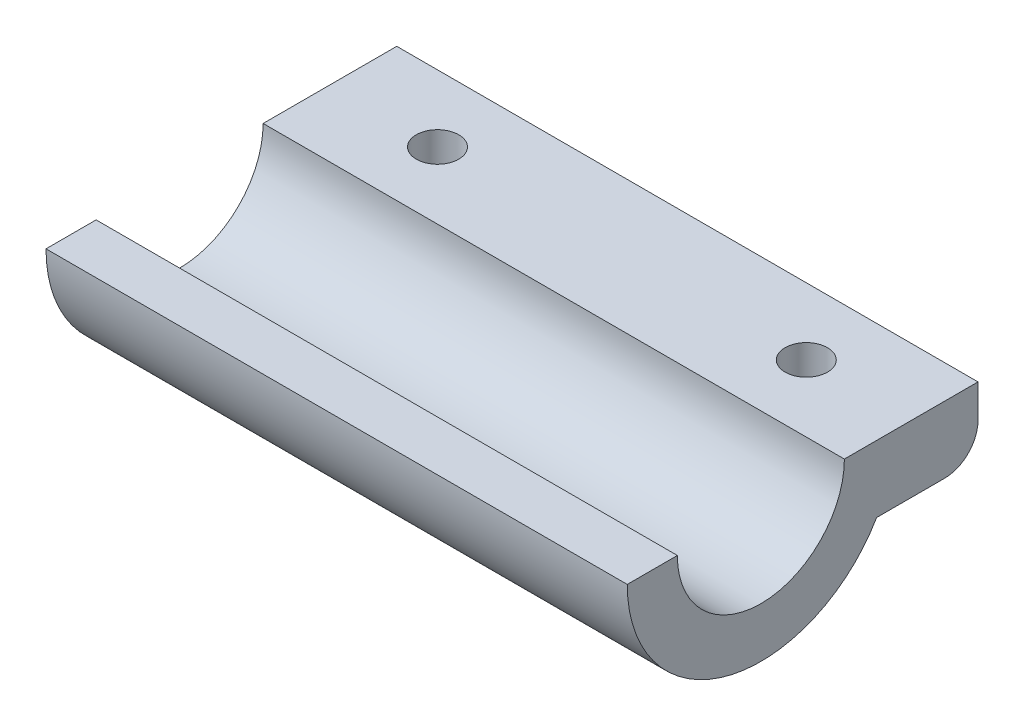
ISO-10303-21;
HEADER;
FILE_DESCRIPTION(('STEP AP214'),'2;1');
FILE_NAME('part.step','',(''),(''),'','','');
FILE_SCHEMA(('AUTOMOTIVE_DESIGN { 1 0 10303 214 1 1 1 1 }'));
ENDSEC;
DATA;
#1=APPLICATION_CONTEXT('core data for automotive mechanical design processes');
#2=APPLICATION_PROTOCOL_DEFINITION('international standard','automotive_design',2000,#1);
#3=PRODUCT_CONTEXT('',#1,'mechanical');
#4=PRODUCT('Part','Part','',(#3));
#5=PRODUCT_RELATED_PRODUCT_CATEGORY('part','',(#4));
#6=PRODUCT_DEFINITION_FORMATION('','',#4);
#7=PRODUCT_DEFINITION_CONTEXT('part definition',#1,'design');
#8=PRODUCT_DEFINITION('design','',#6,#7);
#9=PRODUCT_DEFINITION_SHAPE('','',#8);
#10=(LENGTH_UNIT() NAMED_UNIT(*) SI_UNIT(.MILLI.,.METRE.));
#11=(NAMED_UNIT(*) PLANE_ANGLE_UNIT() SI_UNIT($,.RADIAN.));
#12=(NAMED_UNIT(*) SI_UNIT($,.STERADIAN.) SOLID_ANGLE_UNIT());
#13=UNCERTAINTY_MEASURE_WITH_UNIT(LENGTH_MEASURE(1.E-05),#10,'distance_accuracy_value','');
#14=(GEOMETRIC_REPRESENTATION_CONTEXT(3) GLOBAL_UNCERTAINTY_ASSIGNED_CONTEXT((#13)) GLOBAL_UNIT_ASSIGNED_CONTEXT((#10,
#11,#12)) REPRESENTATION_CONTEXT('',''));
#15=CARTESIAN_POINT('',(0.,0.,0.));
#16=DIRECTION('',(0.,0.,1.));
#17=DIRECTION('',(1.,0.,0.));
#18=AXIS2_PLACEMENT_3D('',#15,#16,#17);
#19=CARTESIAN_POINT('',(87.,0.,12.5));
#20=DIRECTION('',(-1.,0.,0.));
#21=DIRECTION('',(0.,0.,1.));
#22=AXIS2_PLACEMENT_3D('',#19,#20,#21);
#23=CYLINDRICAL_SURFACE('',#22,12.5);
#24=CARTESIAN_POINT('',(0.,0.,12.5));
#25=DIRECTION('',(1.,0.,0.));
#26=DIRECTION('',(0.,0.,-1.));
#27=AXIS2_PLACEMENT_3D('',#24,#25,#26);
#28=CIRCLE('',#27,12.5);
#29=CARTESIAN_POINT('',(0.,0.,25.));
#30=VERTEX_POINT('',#29);
#31=CARTESIAN_POINT('',(0.,0.,0.));
#32=VERTEX_POINT('',#31);
#33=EDGE_CURVE('E131',#30,#32,#28,.T.);
#34=ORIENTED_EDGE('',*,*,#33,.F.);
#35=DIRECTION('',(-1.,0.,0.));
#36=VECTOR('',#35,1.);
#37=CARTESIAN_POINT('',(87.,0.,25.));
#38=LINE('',#37,#36);
#39=CARTESIAN_POINT('',(87.,0.,25.));
#40=VERTEX_POINT('',#39);
#41=EDGE_CURVE('E115',#40,#30,#38,.T.);
#42=ORIENTED_EDGE('',*,*,#41,.F.);
#43=CARTESIAN_POINT('',(87.,0.,12.5));
#44=DIRECTION('',(1.,0.,0.));
#45=DIRECTION('',(0.,0.,-1.));
#46=AXIS2_PLACEMENT_3D('',#43,#44,#45);
#47=CIRCLE('',#46,12.5);
#48=CARTESIAN_POINT('',(87.,0.,0.));
#49=VERTEX_POINT('',#48);
#50=EDGE_CURVE('E110',#40,#49,#47,.T.);
#51=ORIENTED_EDGE('',*,*,#50,.T.);
#52=DIRECTION('',(-1.,0.,0.));
#53=VECTOR('',#52,1.);
#54=CARTESIAN_POINT('',(87.,0.,0.));
#55=LINE('',#54,#53);
#56=EDGE_CURVE('E92',#49,#32,#55,.T.);
#57=ORIENTED_EDGE('',*,*,#56,.T.);
#58=EDGE_LOOP('',(#34,#42,#51,#57));
#59=FACE_BOUND('',#58,.T.);
#60=ADVANCED_FACE('F33',(#59),#23,.F.);
#61=CARTESIAN_POINT('',(87.,0.,32.5));
#62=DIRECTION('',(0.,1.,0.));
#63=DIRECTION('',(0.,0.,1.));
#64=AXIS2_PLACEMENT_3D('',#61,#62,#63);
#65=PLANE('',#64);
#66=DIRECTION('',(0.,0.,-1.));
#67=VECTOR('',#66,1.);
#68=CARTESIAN_POINT('',(0.,0.,32.5));
#69=LINE('',#68,#67);
#70=CARTESIAN_POINT('',(0.,0.,32.5));
#71=VERTEX_POINT('',#70);
#72=EDGE_CURVE('E116',#71,#30,#69,.T.);
#73=ORIENTED_EDGE('',*,*,#72,.F.);
#74=DIRECTION('',(-1.,0.,0.));
#75=VECTOR('',#74,1.);
#76=CARTESIAN_POINT('',(87.,0.,32.5));
#77=LINE('',#76,#75);
#78=CARTESIAN_POINT('',(87.,0.,32.5));
#79=VERTEX_POINT('',#78);
#80=EDGE_CURVE('E141',#79,#71,#77,.T.);
#81=ORIENTED_EDGE('',*,*,#80,.F.);
#82=DIRECTION('',(0.,0.,-1.));
#83=VECTOR('',#82,1.);
#84=CARTESIAN_POINT('',(87.,0.,32.5));
#85=LINE('',#84,#83);
#86=EDGE_CURVE('E103',#79,#40,#85,.T.);
#87=ORIENTED_EDGE('',*,*,#86,.T.);
#88=ORIENTED_EDGE('',*,*,#41,.T.);
#89=EDGE_LOOP('',(#73,#81,#87,#88));
#90=FACE_BOUND('',#89,.T.);
#91=ADVANCED_FACE('F159',(#90),#65,.T.);
#92=CARTESIAN_POINT('',(87.,0.,12.5));
#93=DIRECTION('',(-1.,0.,0.));
#94=DIRECTION('',(0.,0.,1.));
#95=AXIS2_PLACEMENT_3D('',#92,#93,#94);
#96=CYLINDRICAL_SURFACE('',#95,20.);
#97=CARTESIAN_POINT('',(0.,0.,12.5));
#98=DIRECTION('',(1.,0.,0.));
#99=DIRECTION('',(0.,0.,-1.));
#100=AXIS2_PLACEMENT_3D('',#97,#98,#99);
#101=CIRCLE('',#100,20.);
#102=CARTESIAN_POINT('',(0.,-10.,-4.82050807568878));
#103=VERTEX_POINT('',#102);
#104=EDGE_CURVE('E119',#71,#103,#101,.T.);
#105=ORIENTED_EDGE('',*,*,#104,.T.);
#106=DIRECTION('',(-1.,0.,0.));
#107=VECTOR('',#106,1.);
#108=CARTESIAN_POINT('',(87.,-10.,-4.82050807568878));
#109=LINE('',#108,#107);
#110=CARTESIAN_POINT('',(87.,-10.,-4.82050807568878));
#111=VERTEX_POINT('',#110);
#112=EDGE_CURVE('E143',#111,#103,#109,.T.);
#113=ORIENTED_EDGE('',*,*,#112,.F.);
#114=CARTESIAN_POINT('',(87.,0.,12.5));
#115=DIRECTION('',(1.,0.,0.));
#116=DIRECTION('',(0.,0.,-1.));
#117=AXIS2_PLACEMENT_3D('',#114,#115,#116);
#118=CIRCLE('',#117,20.);
#119=EDGE_CURVE('E128',#79,#111,#118,.T.);
#120=ORIENTED_EDGE('',*,*,#119,.F.);
#121=ORIENTED_EDGE('',*,*,#80,.T.);
#122=EDGE_LOOP('',(#105,#113,#120,#121));
#123=FACE_BOUND('',#122,.T.);
#124=ADVANCED_FACE('F163',(#123),#96,.T.);
#125=CARTESIAN_POINT('',(87.,-10.,-4.82050807568878));
#126=DIRECTION('',(0.,1.,0.));
#127=DIRECTION('',(0.,0.,1.));
#128=AXIS2_PLACEMENT_3D('',#125,#126,#127);
#129=PLANE('',#128);
#130=CARTESIAN_POINT('',(71.3,-10.,-10.));
#131=DIRECTION('',(0.,1.,0.));
#132=DIRECTION('',(0.,0.,1.));
#133=AXIS2_PLACEMENT_3D('',#130,#131,#132);
#134=CIRCLE('',#133,3.175);
#135=CARTESIAN_POINT('',(71.3,-10.,-6.82500000000001));
#136=VERTEX_POINT('',#135);
#137=EDGE_CURVE('E122',#136,#136,#134,.T.);
#138=ORIENTED_EDGE('',*,*,#137,.T.);
#139=EDGE_LOOP('',(#138));
#140=FACE_BOUND('',#139,.T.);
#141=CARTESIAN_POINT('',(16.1,-10.,-10.));
#142=DIRECTION('',(0.,1.,0.));
#143=DIRECTION('',(0.,0.,1.));
#144=AXIS2_PLACEMENT_3D('',#141,#142,#143);
#145=CIRCLE('',#144,3.175);
#146=CARTESIAN_POINT('',(16.1,-10.,-6.825));
#147=VERTEX_POINT('',#146);
#148=EDGE_CURVE('E197',#147,#147,#145,.T.);
#149=ORIENTED_EDGE('',*,*,#148,.T.);
#150=EDGE_LOOP('',(#149));
#151=FACE_BOUND('',#150,.T.);
#152=DIRECTION('',(0.,0.,-1.));
#153=VECTOR('',#152,1.);
#154=CARTESIAN_POINT('',(0.,-10.,-4.82050807568878));
#155=LINE('',#154,#153);
#156=CARTESIAN_POINT('',(0.,-10.,-15.));
#157=VERTEX_POINT('',#156);
#158=EDGE_CURVE('E136',#103,#157,#155,.T.);
#159=ORIENTED_EDGE('',*,*,#158,.T.);
#160=DIRECTION('',(-1.,0.,0.));
#161=VECTOR('',#160,1.);
#162=CARTESIAN_POINT('',(87.,-10.,-15.));
#163=LINE('',#162,#161);
#164=CARTESIAN_POINT('',(87.,-10.,-15.));
#165=VERTEX_POINT('',#164);
#166=EDGE_CURVE('E41',#157,#165,#163,.F.);
#167=ORIENTED_EDGE('',*,*,#166,.T.);
#168=DIRECTION('',(0.,0.,-1.));
#169=VECTOR('',#168,1.);
#170=CARTESIAN_POINT('',(87.,-10.,-4.82050807568878));
#171=LINE('',#170,#169);
#172=EDGE_CURVE('E126',#111,#165,#171,.T.);
#173=ORIENTED_EDGE('',*,*,#172,.F.);
#174=ORIENTED_EDGE('',*,*,#112,.T.);
#175=EDGE_LOOP('',(#159,#167,#173,#174));
#176=FACE_BOUND('',#175,.T.);
#177=ADVANCED_FACE('F164',(#140,#151,#176),#129,.F.);
#178=CARTESIAN_POINT('',(87.,0.,-20.));
#179=DIRECTION('',(0.,0.,-1.));
#180=DIRECTION('',(-1.,0.,0.));
#181=AXIS2_PLACEMENT_3D('',#178,#179,#180);
#182=PLANE('',#181);
#183=DIRECTION('',(0.,-1.,0.));
#184=VECTOR('',#183,1.);
#185=CARTESIAN_POINT('',(87.,0.,-20.));
#186=LINE('',#185,#184);
#187=CARTESIAN_POINT('',(87.,0.,-20.));
#188=VERTEX_POINT('',#187);
#189=CARTESIAN_POINT('',(87.,-5.,-20.));
#190=VERTEX_POINT('',#189);
#191=EDGE_CURVE('E113',#188,#190,#186,.T.);
#192=ORIENTED_EDGE('',*,*,#191,.T.);
#193=DIRECTION('',(-1.,0.,0.));
#194=VECTOR('',#193,1.);
#195=CARTESIAN_POINT('',(0.,-5.,-20.));
#196=LINE('',#195,#194);
#197=CARTESIAN_POINT('',(0.,-5.,-20.));
#198=VERTEX_POINT('',#197);
#199=EDGE_CURVE('E140',#190,#198,#196,.T.);
#200=ORIENTED_EDGE('',*,*,#199,.T.);
#201=DIRECTION('',(0.,-1.,0.));
#202=VECTOR('',#201,1.);
#203=CARTESIAN_POINT('',(0.,0.,-20.));
#204=LINE('',#203,#202);
#205=CARTESIAN_POINT('',(0.,0.,-20.));
#206=VERTEX_POINT('',#205);
#207=EDGE_CURVE('E134',#206,#198,#204,.T.);
#208=ORIENTED_EDGE('',*,*,#207,.F.);
#209=DIRECTION('',(-1.,0.,0.));
#210=VECTOR('',#209,1.);
#211=CARTESIAN_POINT('',(87.,0.,-20.));
#212=LINE('',#211,#210);
#213=EDGE_CURVE('E102',#188,#206,#212,.T.);
#214=ORIENTED_EDGE('',*,*,#213,.F.);
#215=EDGE_LOOP('',(#192,#200,#208,#214));
#216=FACE_BOUND('',#215,.T.);
#217=ADVANCED_FACE('F152',(#216),#182,.T.);
#218=CARTESIAN_POINT('',(87.,0.,0.));
#219=DIRECTION('',(0.,1.,0.));
#220=DIRECTION('',(0.,0.,1.));
#221=AXIS2_PLACEMENT_3D('',#218,#219,#220);
#222=PLANE('',#221);
#223=CARTESIAN_POINT('',(71.3,0.,-10.));
#224=DIRECTION('',(0.,1.,0.));
#225=DIRECTION('',(0.,0.,1.));
#226=AXIS2_PLACEMENT_3D('',#223,#224,#225);
#227=CIRCLE('',#226,3.175);
#228=CARTESIAN_POINT('',(71.3,0.,-6.82500000000001));
#229=VERTEX_POINT('',#228);
#230=EDGE_CURVE('E191',#229,#229,#227,.T.);
#231=ORIENTED_EDGE('',*,*,#230,.F.);
#232=EDGE_LOOP('',(#231));
#233=FACE_BOUND('',#232,.T.);
#234=CARTESIAN_POINT('',(16.1,0.,-10.));
#235=DIRECTION('',(0.,1.,0.));
#236=DIRECTION('',(0.,0.,1.));
#237=AXIS2_PLACEMENT_3D('',#234,#235,#236);
#238=CIRCLE('',#237,3.175);
#239=CARTESIAN_POINT('',(16.1,0.,-6.825));
#240=VERTEX_POINT('',#239);
#241=EDGE_CURVE('E194',#240,#240,#238,.T.);
#242=ORIENTED_EDGE('',*,*,#241,.F.);
#243=EDGE_LOOP('',(#242));
#244=FACE_BOUND('',#243,.T.);
#245=DIRECTION('',(0.,0.,-1.));
#246=VECTOR('',#245,1.);
#247=CARTESIAN_POINT('',(0.,0.,0.));
#248=LINE('',#247,#246);
#249=EDGE_CURVE('E97',#32,#206,#248,.T.);
#250=ORIENTED_EDGE('',*,*,#249,.F.);
#251=ORIENTED_EDGE('',*,*,#56,.F.);
#252=DIRECTION('',(0.,0.,-1.));
#253=VECTOR('',#252,1.);
#254=CARTESIAN_POINT('',(87.,0.,0.));
#255=LINE('',#254,#253);
#256=EDGE_CURVE('E95',#49,#188,#255,.T.);
#257=ORIENTED_EDGE('',*,*,#256,.T.);
#258=ORIENTED_EDGE('',*,*,#213,.T.);
#259=EDGE_LOOP('',(#250,#251,#257,#258));
#260=FACE_BOUND('',#259,.T.);
#261=ADVANCED_FACE('F94',(#233,#244,#260),#222,.T.);
#262=CARTESIAN_POINT('',(87.,0.,12.5));
#263=DIRECTION('',(1.,0.,0.));
#264=DIRECTION('',(0.,0.,-1.));
#265=AXIS2_PLACEMENT_3D('',#262,#263,#264);
#266=PLANE('',#265);
#267=ORIENTED_EDGE('',*,*,#172,.T.);
#268=CARTESIAN_POINT('',(87.,-5.,-15.));
#269=DIRECTION('',(1.,0.,0.));
#270=DIRECTION('',(0.,0.,-1.));
#271=AXIS2_PLACEMENT_3D('',#268,#269,#270);
#272=CIRCLE('',#271,5.);
#273=EDGE_CURVE('E11',#165,#190,#272,.T.);
#274=ORIENTED_EDGE('',*,*,#273,.T.);
#275=ORIENTED_EDGE('',*,*,#191,.F.);
#276=ORIENTED_EDGE('',*,*,#256,.F.);
#277=ORIENTED_EDGE('',*,*,#50,.F.);
#278=ORIENTED_EDGE('',*,*,#86,.F.);
#279=ORIENTED_EDGE('',*,*,#119,.T.);
#280=EDGE_LOOP('',(#267,#274,#275,#276,#277,#278,#279));
#281=FACE_BOUND('',#280,.T.);
#282=ADVANCED_FACE('F108',(#281),#266,.T.);
#283=CARTESIAN_POINT('',(0.,0.,12.5));
#284=DIRECTION('',(1.,0.,0.));
#285=DIRECTION('',(0.,0.,-1.));
#286=AXIS2_PLACEMENT_3D('',#283,#284,#285);
#287=PLANE('',#286);
#288=ORIENTED_EDGE('',*,*,#207,.T.);
#289=CARTESIAN_POINT('',(0.,-5.,-15.));
#290=DIRECTION('',(1.,0.,0.));
#291=DIRECTION('',(0.,0.,-1.));
#292=AXIS2_PLACEMENT_3D('',#289,#290,#291);
#293=CIRCLE('',#292,5.);
#294=EDGE_CURVE('E55',#198,#157,#293,.F.);
#295=ORIENTED_EDGE('',*,*,#294,.T.);
#296=ORIENTED_EDGE('',*,*,#158,.F.);
#297=ORIENTED_EDGE('',*,*,#104,.F.);
#298=ORIENTED_EDGE('',*,*,#72,.T.);
#299=ORIENTED_EDGE('',*,*,#33,.T.);
#300=ORIENTED_EDGE('',*,*,#249,.T.);
#301=EDGE_LOOP('',(#288,#295,#296,#297,#298,#299,#300));
#302=FACE_BOUND('',#301,.T.);
#303=ADVANCED_FACE('F155',(#302),#287,.F.);
#304=CARTESIAN_POINT('',(16.1,-20.,-10.));
#305=DIRECTION('',(0.,1.,0.));
#306=DIRECTION('',(0.,0.,1.));
#307=AXIS2_PLACEMENT_3D('',#304,#305,#306);
#308=CYLINDRICAL_SURFACE('',#307,3.175);
#309=ORIENTED_EDGE('',*,*,#241,.T.);
#310=EDGE_LOOP('',(#309));
#311=FACE_BOUND('',#310,.T.);
#312=ORIENTED_EDGE('',*,*,#148,.F.);
#313=EDGE_LOOP('',(#312));
#314=FACE_BOUND('',#313,.T.);
#315=ADVANCED_FACE('F205',(#311,#314),#308,.F.);
#316=CARTESIAN_POINT('',(71.3,-20.,-10.));
#317=DIRECTION('',(0.,1.,0.));
#318=DIRECTION('',(0.,0.,1.));
#319=AXIS2_PLACEMENT_3D('',#316,#317,#318);
#320=CYLINDRICAL_SURFACE('',#319,3.175);
#321=ORIENTED_EDGE('',*,*,#230,.T.);
#322=EDGE_LOOP('',(#321));
#323=FACE_BOUND('',#322,.T.);
#324=ORIENTED_EDGE('',*,*,#137,.F.);
#325=EDGE_LOOP('',(#324));
#326=FACE_BOUND('',#325,.T.);
#327=ADVANCED_FACE('F203',(#323,#326),#320,.F.);
#328=CARTESIAN_POINT('',(87.,-5.,-15.));
#329=DIRECTION('',(1.,0.,0.));
#330=DIRECTION('',(0.,0.,-1.));
#331=AXIS2_PLACEMENT_3D('',#328,#329,#330);
#332=CYLINDRICAL_SURFACE('',#331,5.);
#333=ORIENTED_EDGE('',*,*,#273,.F.);
#334=ORIENTED_EDGE('',*,*,#166,.F.);
#335=ORIENTED_EDGE('',*,*,#294,.F.);
#336=ORIENTED_EDGE('',*,*,#199,.F.);
#337=EDGE_LOOP('',(#333,#334,#335,#336));
#338=FACE_BOUND('',#337,.T.);
#339=ADVANCED_FACE('F35',(#338),#332,.T.);
#340=CLOSED_SHELL('',(#60,#91,#124,#177,#217,#261,#282,#303,#315,#327,#339));
#341=MANIFOLD_SOLID_BREP('B2',#340);
#342=ADVANCED_BREP_SHAPE_REPRESENTATION('',(#18,#341),#14);
#343=SHAPE_DEFINITION_REPRESENTATION(#9,#342);
ENDSEC;
END-ISO-10303-21;
